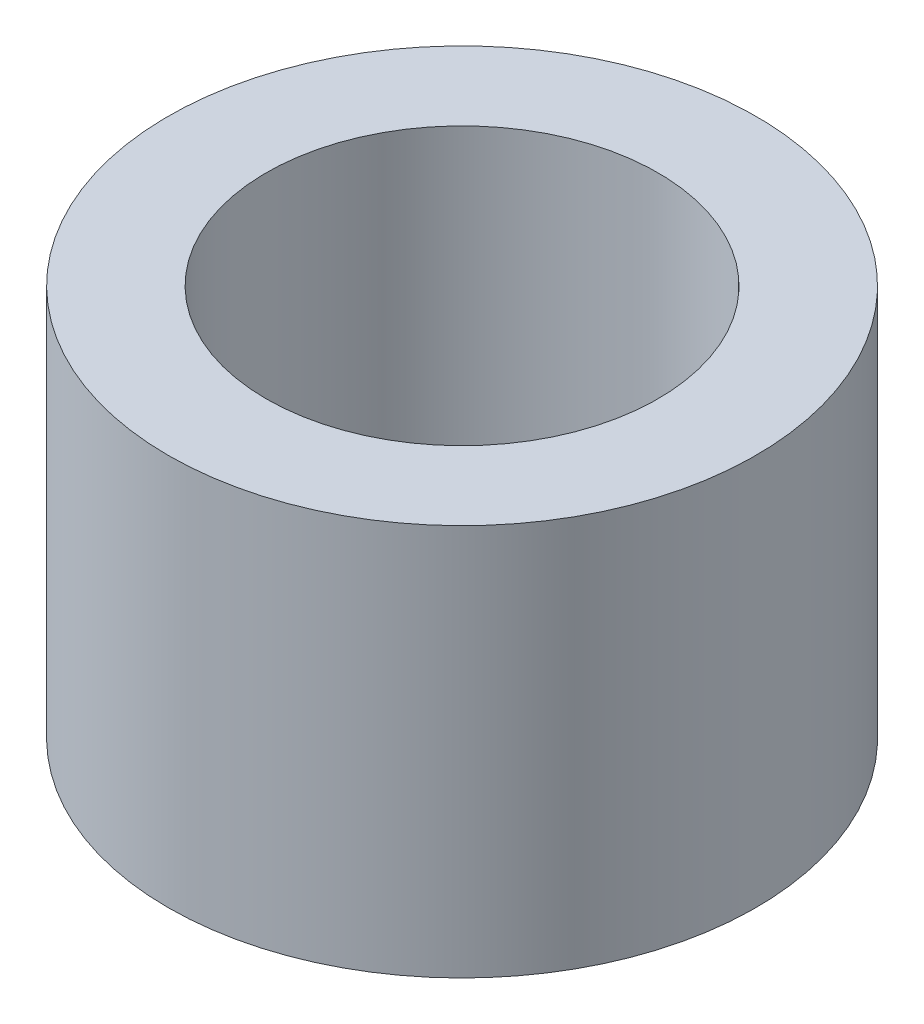
ISO-10303-21;
HEADER;
FILE_DESCRIPTION(('STEP AP214'),'2;1');
FILE_NAME('part.step','',(''),(''),'','','');
FILE_SCHEMA(('AUTOMOTIVE_DESIGN { 1 0 10303 214 1 1 1 1 }'));
ENDSEC;
DATA;
#1=APPLICATION_CONTEXT('core data for automotive mechanical design processes');
#2=APPLICATION_PROTOCOL_DEFINITION('international standard','automotive_design',2000,#1);
#3=PRODUCT_CONTEXT('',#1,'mechanical');
#4=PRODUCT('Part','Part','',(#3));
#5=PRODUCT_RELATED_PRODUCT_CATEGORY('part','',(#4));
#6=PRODUCT_DEFINITION_FORMATION('','',#4);
#7=PRODUCT_DEFINITION_CONTEXT('part definition',#1,'design');
#8=PRODUCT_DEFINITION('design','',#6,#7);
#9=PRODUCT_DEFINITION_SHAPE('','',#8);
#10=(LENGTH_UNIT() NAMED_UNIT(*) SI_UNIT(.MILLI.,.METRE.));
#11=(NAMED_UNIT(*) PLANE_ANGLE_UNIT() SI_UNIT($,.RADIAN.));
#12=(NAMED_UNIT(*) SI_UNIT($,.STERADIAN.) SOLID_ANGLE_UNIT());
#13=UNCERTAINTY_MEASURE_WITH_UNIT(LENGTH_MEASURE(1.E-05),#10,'distance_accuracy_value','');
#14=(GEOMETRIC_REPRESENTATION_CONTEXT(3) GLOBAL_UNCERTAINTY_ASSIGNED_CONTEXT((#13)) GLOBAL_UNIT_ASSIGNED_CONTEXT((#10,
#11,#12)) REPRESENTATION_CONTEXT('',''));
#15=CARTESIAN_POINT('',(0.,0.,0.));
#16=DIRECTION('',(0.,0.,1.));
#17=DIRECTION('',(1.,0.,0.));
#18=AXIS2_PLACEMENT_3D('',#15,#16,#17);
#19=CARTESIAN_POINT('',(0.,3.175,0.));
#20=DIRECTION('',(0.,1.,0.));
#21=DIRECTION('',(0.,0.,1.));
#22=AXIS2_PLACEMENT_3D('',#19,#20,#21);
#23=CYLINDRICAL_SURFACE('',#22,3.175);
#24=CARTESIAN_POINT('',(0.,3.175,0.));
#25=DIRECTION('',(0.,1.,0.));
#26=DIRECTION('',(0.,0.,1.));
#27=AXIS2_PLACEMENT_3D('',#24,#25,#26);
#28=CIRCLE('',#27,3.175);
#29=CARTESIAN_POINT('',(0.,3.175,3.175));
#30=VERTEX_POINT('',#29);
#31=EDGE_CURVE('E45',#30,#30,#28,.T.);
#32=ORIENTED_EDGE('',*,*,#31,.T.);
#33=EDGE_LOOP('',(#32));
#34=FACE_BOUND('',#33,.T.);
#35=CARTESIAN_POINT('',(0.,-3.175,0.));
#36=DIRECTION('',(0.,1.,0.));
#37=DIRECTION('',(0.,0.,1.));
#38=AXIS2_PLACEMENT_3D('',#35,#36,#37);
#39=CIRCLE('',#38,3.175);
#40=CARTESIAN_POINT('',(0.,-3.175,3.175));
#41=VERTEX_POINT('',#40);
#42=EDGE_CURVE('E10',#41,#41,#39,.T.);
#43=ORIENTED_EDGE('',*,*,#42,.F.);
#44=EDGE_LOOP('',(#43));
#45=FACE_BOUND('',#44,.T.);
#46=ADVANCED_FACE('F31',(#34,#45),#23,.F.);
#47=CARTESIAN_POINT('',(-4.7625,-3.175,0.));
#48=DIRECTION('',(0.,-1.,0.));
#49=DIRECTION('',(0.,0.,-1.));
#50=AXIS2_PLACEMENT_3D('',#47,#48,#49);
#51=PLANE('',#50);
#52=ORIENTED_EDGE('',*,*,#42,.T.);
#53=EDGE_LOOP('',(#52));
#54=FACE_BOUND('',#53,.T.);
#55=CARTESIAN_POINT('',(0.,-3.175,0.));
#56=DIRECTION('',(0.,1.,0.));
#57=DIRECTION('',(0.,0.,1.));
#58=AXIS2_PLACEMENT_3D('',#55,#56,#57);
#59=CIRCLE('',#58,4.7625);
#60=CARTESIAN_POINT('',(0.,-3.175,4.7625));
#61=VERTEX_POINT('',#60);
#62=EDGE_CURVE('E37',#61,#61,#59,.T.);
#63=ORIENTED_EDGE('',*,*,#62,.F.);
#64=EDGE_LOOP('',(#63));
#65=FACE_BOUND('',#64,.T.);
#66=ADVANCED_FACE('F61',(#54,#65),#51,.T.);
#67=CARTESIAN_POINT('',(0.,3.175,0.));
#68=DIRECTION('',(0.,1.,0.));
#69=DIRECTION('',(0.,0.,1.));
#70=AXIS2_PLACEMENT_3D('',#67,#68,#69);
#71=CYLINDRICAL_SURFACE('',#70,4.7625);
#72=ORIENTED_EDGE('',*,*,#62,.T.);
#73=EDGE_LOOP('',(#72));
#74=FACE_BOUND('',#73,.T.);
#75=CARTESIAN_POINT('',(0.,3.175,0.));
#76=DIRECTION('',(0.,1.,0.));
#77=DIRECTION('',(0.,0.,1.));
#78=AXIS2_PLACEMENT_3D('',#75,#76,#77);
#79=CIRCLE('',#78,4.7625);
#80=CARTESIAN_POINT('',(0.,3.175,4.7625));
#81=VERTEX_POINT('',#80);
#82=EDGE_CURVE('E41',#81,#81,#79,.T.);
#83=ORIENTED_EDGE('',*,*,#82,.F.);
#84=EDGE_LOOP('',(#83));
#85=FACE_BOUND('',#84,.T.);
#86=ADVANCED_FACE('F55',(#74,#85),#71,.T.);
#87=CARTESIAN_POINT('',(-4.7625,3.175,0.));
#88=DIRECTION('',(0.,1.,0.));
#89=DIRECTION('',(0.,0.,1.));
#90=AXIS2_PLACEMENT_3D('',#87,#88,#89);
#91=PLANE('',#90);
#92=ORIENTED_EDGE('',*,*,#82,.T.);
#93=EDGE_LOOP('',(#92));
#94=FACE_BOUND('',#93,.T.);
#95=ORIENTED_EDGE('',*,*,#31,.F.);
#96=EDGE_LOOP('',(#95));
#97=FACE_BOUND('',#96,.T.);
#98=ADVANCED_FACE('F53',(#94,#97),#91,.T.);
#99=CLOSED_SHELL('',(#46,#66,#86,#98));
#100=MANIFOLD_SOLID_BREP('B2',#99);
#101=ADVANCED_BREP_SHAPE_REPRESENTATION('',(#18,#100),#14);
#102=SHAPE_DEFINITION_REPRESENTATION(#9,#101);
ENDSEC;
END-ISO-10303-21;
